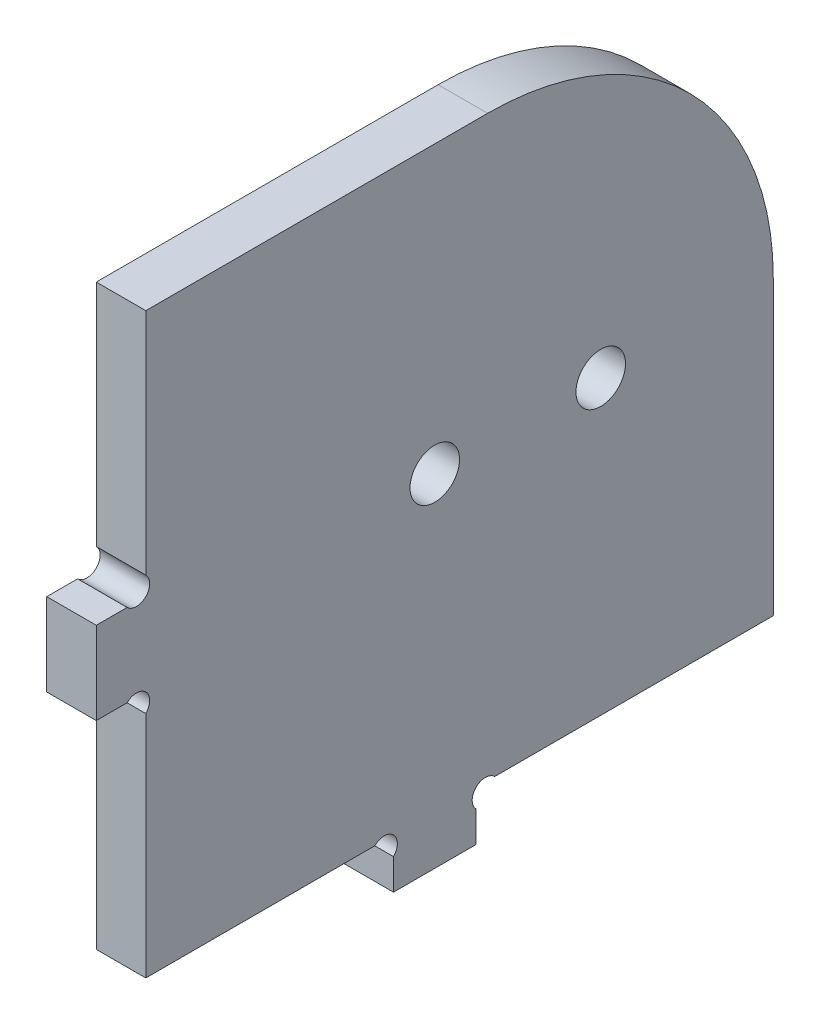
ISO-10303-21;
HEADER;
FILE_DESCRIPTION(('STEP AP214'),'2;1');
FILE_NAME('part.step','',(''),(''),'','','');
FILE_SCHEMA(('AUTOMOTIVE_DESIGN { 1 0 10303 214 1 1 1 1 }'));
ENDSEC;
DATA;
#1=APPLICATION_CONTEXT('core data for automotive mechanical design processes');
#2=APPLICATION_PROTOCOL_DEFINITION('international standard','automotive_design',2000,#1);
#3=PRODUCT_CONTEXT('',#1,'mechanical');
#4=PRODUCT('Part','Part','',(#3));
#5=PRODUCT_RELATED_PRODUCT_CATEGORY('part','',(#4));
#6=PRODUCT_DEFINITION_FORMATION('','',#4);
#7=PRODUCT_DEFINITION_CONTEXT('part definition',#1,'design');
#8=PRODUCT_DEFINITION('design','',#6,#7);
#9=PRODUCT_DEFINITION_SHAPE('','',#8);
#10=(LENGTH_UNIT() NAMED_UNIT(*) SI_UNIT(.MILLI.,.METRE.));
#11=(NAMED_UNIT(*) PLANE_ANGLE_UNIT() SI_UNIT($,.RADIAN.));
#12=(NAMED_UNIT(*) SI_UNIT($,.STERADIAN.) SOLID_ANGLE_UNIT());
#13=UNCERTAINTY_MEASURE_WITH_UNIT(LENGTH_MEASURE(1.E-05),#10,'distance_accuracy_value','');
#14=(GEOMETRIC_REPRESENTATION_CONTEXT(3) GLOBAL_UNCERTAINTY_ASSIGNED_CONTEXT((#13)) GLOBAL_UNIT_ASSIGNED_CONTEXT((#10,
#11,#12)) REPRESENTATION_CONTEXT('',''));
#15=CARTESIAN_POINT('',(0.,0.,0.));
#16=DIRECTION('',(0.,0.,1.));
#17=DIRECTION('',(1.,0.,0.));
#18=AXIS2_PLACEMENT_3D('',#15,#16,#17);
#19=CARTESIAN_POINT('',(6.,4.86862915010152,-47.1313708498985));
#20=DIRECTION('',(1.,0.,0.));
#21=DIRECTION('',(0.,0.,-1.));
#22=AXIS2_PLACEMENT_3D('',#19,#20,#21);
#23=PLANE('',#22);
#24=CARTESIAN_POINT('',(6.,41.4,-41.));
#25=DIRECTION('',(1.,0.,0.));
#26=DIRECTION('',(0.,0.,-1.));
#27=AXIS2_PLACEMENT_3D('',#24,#25,#26);
#28=CIRCLE('',#27,3.);
#29=CARTESIAN_POINT('',(6.,41.4,-44.));
#30=VERTEX_POINT('',#29);
#31=EDGE_CURVE('E187',#30,#30,#28,.T.);
#32=ORIENTED_EDGE('',*,*,#31,.F.);
#33=EDGE_LOOP('',(#32));
#34=FACE_BOUND('',#33,.T.);
#35=CARTESIAN_POINT('',(6.,4.86862915010152,-47.1313708498985));
#36=DIRECTION('',(-1.,0.,0.));
#37=DIRECTION('',(0.,0.,-1.));
#38=AXIS2_PLACEMENT_3D('',#35,#36,#37);
#39=CIRCLE('',#38,1.60000000000001);
#40=CARTESIAN_POINT('',(6.,3.73725830020304,-46.));
#41=VERTEX_POINT('',#40);
#42=CARTESIAN_POINT('',(6.,6.,-48.262741699797));
#43=VERTEX_POINT('',#42);
#44=EDGE_CURVE('E216',#41,#43,#39,.T.);
#45=ORIENTED_EDGE('',*,*,#44,.T.);
#46=DIRECTION('',(0.,0.,-1.));
#47=VECTOR('',#46,1.);
#48=CARTESIAN_POINT('',(6.,6.,-82.));
#49=LINE('',#48,#47);
#50=CARTESIAN_POINT('',(6.,6.,-82.));
#51=VERTEX_POINT('',#50);
#52=EDGE_CURVE('E119',#43,#51,#49,.T.);
#53=ORIENTED_EDGE('',*,*,#52,.T.);
#54=DIRECTION('',(0.,1.,0.));
#55=VECTOR('',#54,1.);
#56=CARTESIAN_POINT('',(6.,41.4,-82.));
#57=LINE('',#56,#55);
#58=CARTESIAN_POINT('',(6.,41.4,-82.));
#59=VERTEX_POINT('',#58);
#60=EDGE_CURVE('E258',#51,#59,#57,.T.);
#61=ORIENTED_EDGE('',*,*,#60,.T.);
#62=CARTESIAN_POINT('',(6.,41.4,-47.4));
#63=DIRECTION('',(1.,0.,0.));
#64=DIRECTION('',(0.,0.,-1.));
#65=AXIS2_PLACEMENT_3D('',#62,#63,#64);
#66=CIRCLE('',#65,34.6);
#67=CARTESIAN_POINT('',(6.,76.,-47.4));
#68=VERTEX_POINT('',#67);
#69=EDGE_CURVE('E277',#59,#68,#66,.T.);
#70=ORIENTED_EDGE('',*,*,#69,.T.);
#71=DIRECTION('',(0.,0.,1.));
#72=VECTOR('',#71,1.);
#73=CARTESIAN_POINT('',(6.,76.,-6.));
#74=LINE('',#73,#72);
#75=CARTESIAN_POINT('',(6.,76.,-6.));
#76=VERTEX_POINT('',#75);
#77=EDGE_CURVE('E274',#68,#76,#74,.T.);
#78=ORIENTED_EDGE('',*,*,#77,.T.);
#79=DIRECTION('',(0.,-1.,0.));
#80=VECTOR('',#79,1.);
#81=CARTESIAN_POINT('',(6.,48.2627416997972,-6.));
#82=LINE('',#81,#80);
#83=CARTESIAN_POINT('',(6.,48.2627416997972,-6.));
#84=VERTEX_POINT('',#83);
#85=EDGE_CURVE('E276',#76,#84,#82,.T.);
#86=ORIENTED_EDGE('',*,*,#85,.T.);
#87=CARTESIAN_POINT('',(6.,47.1313708498986,-4.86862915010136));
#88=DIRECTION('',(-1.,0.,0.));
#89=DIRECTION('',(0.,0.,1.));
#90=AXIS2_PLACEMENT_3D('',#87,#88,#89);
#91=CIRCLE('',#90,1.60000000000023);
#92=CARTESIAN_POINT('',(6.,46.,-3.73725830020272));
#93=VERTEX_POINT('',#92);
#94=EDGE_CURVE('E279',#84,#93,#91,.T.);
#95=ORIENTED_EDGE('',*,*,#94,.T.);
#96=DIRECTION('',(0.,0.,1.));
#97=VECTOR('',#96,1.);
#98=CARTESIAN_POINT('',(6.,46.,0.));
#99=LINE('',#98,#97);
#100=CARTESIAN_POINT('',(6.,46.,0.));
#101=VERTEX_POINT('',#100);
#102=EDGE_CURVE('E285',#93,#101,#99,.T.);
#103=ORIENTED_EDGE('',*,*,#102,.T.);
#104=DIRECTION('',(0.,-1.,0.));
#105=VECTOR('',#104,1.);
#106=CARTESIAN_POINT('',(6.,36.,0.));
#107=LINE('',#106,#105);
#108=CARTESIAN_POINT('',(6.,36.,0.));
#109=VERTEX_POINT('',#108);
#110=EDGE_CURVE('E287',#101,#109,#107,.T.);
#111=ORIENTED_EDGE('',*,*,#110,.T.);
#112=DIRECTION('',(0.,0.,-1.));
#113=VECTOR('',#112,1.);
#114=CARTESIAN_POINT('',(6.,36.,-3.7372583002027));
#115=LINE('',#114,#113);
#116=CARTESIAN_POINT('',(6.,36.,-3.7372583002027));
#117=VERTEX_POINT('',#116);
#118=EDGE_CURVE('E289',#109,#117,#115,.T.);
#119=ORIENTED_EDGE('',*,*,#118,.T.);
#120=CARTESIAN_POINT('',(6.,34.8686291501013,-4.86862915010135));
#121=DIRECTION('',(-1.,0.,0.));
#122=DIRECTION('',(0.,0.,-1.));
#123=AXIS2_PLACEMENT_3D('',#120,#121,#122);
#124=CIRCLE('',#123,1.60000000000024);
#125=CARTESIAN_POINT('',(6.,33.7372583002027,-6.));
#126=VERTEX_POINT('',#125);
#127=EDGE_CURVE('E291',#117,#126,#124,.T.);
#128=ORIENTED_EDGE('',*,*,#127,.T.);
#129=DIRECTION('',(0.,-1.,0.));
#130=VECTOR('',#129,1.);
#131=CARTESIAN_POINT('',(6.,6.,-6.));
#132=LINE('',#131,#130);
#133=CARTESIAN_POINT('',(6.,6.,-6.));
#134=VERTEX_POINT('',#133);
#135=EDGE_CURVE('E293',#126,#134,#132,.T.);
#136=ORIENTED_EDGE('',*,*,#135,.T.);
#137=DIRECTION('',(0.,0.,-1.));
#138=VECTOR('',#137,1.);
#139=CARTESIAN_POINT('',(6.,6.,-33.7372583002031));
#140=LINE('',#139,#138);
#141=CARTESIAN_POINT('',(6.,6.,-33.7372583002031));
#142=VERTEX_POINT('',#141);
#143=EDGE_CURVE('E295',#134,#142,#140,.T.);
#144=ORIENTED_EDGE('',*,*,#143,.T.);
#145=CARTESIAN_POINT('',(6.,4.86862915010151,-34.8686291501015));
#146=DIRECTION('',(-1.,0.,0.));
#147=DIRECTION('',(0.,0.,1.));
#148=AXIS2_PLACEMENT_3D('',#145,#146,#147);
#149=CIRCLE('',#148,1.60000000000001);
#150=CARTESIAN_POINT('',(6.,3.73725830020304,-36.));
#151=VERTEX_POINT('',#150);
#152=EDGE_CURVE('E165',#142,#151,#149,.T.);
#153=ORIENTED_EDGE('',*,*,#152,.T.);
#154=DIRECTION('',(0.,-1.,0.));
#155=VECTOR('',#154,1.);
#156=CARTESIAN_POINT('',(6.,0.,-36.));
#157=LINE('',#156,#155);
#158=CARTESIAN_POINT('',(6.,0.,-36.));
#159=VERTEX_POINT('',#158);
#160=EDGE_CURVE('E159',#151,#159,#157,.T.);
#161=ORIENTED_EDGE('',*,*,#160,.T.);
#162=DIRECTION('',(0.,0.,-1.));
#163=VECTOR('',#162,1.);
#164=CARTESIAN_POINT('',(6.,0.,-46.));
#165=LINE('',#164,#163);
#166=CARTESIAN_POINT('',(6.,0.,-46.));
#167=VERTEX_POINT('',#166);
#168=EDGE_CURVE('E163',#159,#167,#165,.T.);
#169=ORIENTED_EDGE('',*,*,#168,.T.);
#170=DIRECTION('',(0.,1.,0.));
#171=VECTOR('',#170,1.);
#172=CARTESIAN_POINT('',(6.,3.73725830020304,-46.));
#173=LINE('',#172,#171);
#174=EDGE_CURVE('E49',#167,#41,#173,.T.);
#175=ORIENTED_EDGE('',*,*,#174,.T.);
#176=EDGE_LOOP('',(#45,#53,#61,#70,#78,#86,#95,#103,#111,#119,#128,#136,#144,#153,#161,#169,#175));
#177=FACE_BOUND('',#176,.T.);
#178=CARTESIAN_POINT('',(6.,41.4,-61.1));
#179=DIRECTION('',(1.,0.,0.));
#180=DIRECTION('',(0.,0.,-1.));
#181=AXIS2_PLACEMENT_3D('',#178,#179,#180);
#182=CIRCLE('',#181,3.00000000000001);
#183=CARTESIAN_POINT('',(6.,41.4,-64.1));
#184=VERTEX_POINT('',#183);
#185=EDGE_CURVE('E338',#184,#184,#182,.T.);
#186=ORIENTED_EDGE('',*,*,#185,.F.);
#187=EDGE_LOOP('',(#186));
#188=FACE_BOUND('',#187,.T.);
#189=ADVANCED_FACE('F32',(#34,#177,#188),#23,.T.);
#190=CARTESIAN_POINT('',(0.,4.86862915010152,-47.1313708498985));
#191=DIRECTION('',(1.,0.,0.));
#192=DIRECTION('',(0.,0.,-1.));
#193=AXIS2_PLACEMENT_3D('',#190,#191,#192);
#194=PLANE('',#193);
#195=CARTESIAN_POINT('',(0.,41.4,-41.));
#196=DIRECTION('',(1.,0.,0.));
#197=DIRECTION('',(0.,0.,-1.));
#198=AXIS2_PLACEMENT_3D('',#195,#196,#197);
#199=CIRCLE('',#198,3.);
#200=CARTESIAN_POINT('',(0.,41.4,-44.));
#201=VERTEX_POINT('',#200);
#202=EDGE_CURVE('E343',#201,#201,#199,.T.);
#203=ORIENTED_EDGE('',*,*,#202,.T.);
#204=EDGE_LOOP('',(#203));
#205=FACE_BOUND('',#204,.T.);
#206=CARTESIAN_POINT('',(0.,4.86862915010152,-47.1313708498985));
#207=DIRECTION('',(-1.,0.,0.));
#208=DIRECTION('',(0.,0.,-1.));
#209=AXIS2_PLACEMENT_3D('',#206,#207,#208);
#210=CIRCLE('',#209,1.60000000000001);
#211=CARTESIAN_POINT('',(0.,3.73725830020304,-46.));
#212=VERTEX_POINT('',#211);
#213=CARTESIAN_POINT('',(0.,6.,-48.262741699797));
#214=VERTEX_POINT('',#213);
#215=EDGE_CURVE('E183',#212,#214,#210,.T.);
#216=ORIENTED_EDGE('',*,*,#215,.F.);
#217=DIRECTION('',(0.,1.,0.));
#218=VECTOR('',#217,1.);
#219=CARTESIAN_POINT('',(0.,3.73725830020304,-46.));
#220=LINE('',#219,#218);
#221=CARTESIAN_POINT('',(0.,0.,-46.));
#222=VERTEX_POINT('',#221);
#223=EDGE_CURVE('E111',#222,#212,#220,.T.);
#224=ORIENTED_EDGE('',*,*,#223,.F.);
#225=DIRECTION('',(0.,0.,-1.));
#226=VECTOR('',#225,1.);
#227=CARTESIAN_POINT('',(0.,0.,-46.));
#228=LINE('',#227,#226);
#229=CARTESIAN_POINT('',(0.,0.,-36.));
#230=VERTEX_POINT('',#229);
#231=EDGE_CURVE('E105',#230,#222,#228,.T.);
#232=ORIENTED_EDGE('',*,*,#231,.F.);
#233=DIRECTION('',(0.,-1.,0.));
#234=VECTOR('',#233,1.);
#235=CARTESIAN_POINT('',(0.,0.,-36.));
#236=LINE('',#235,#234);
#237=CARTESIAN_POINT('',(0.,3.73725830020304,-36.));
#238=VERTEX_POINT('',#237);
#239=EDGE_CURVE('E173',#238,#230,#236,.T.);
#240=ORIENTED_EDGE('',*,*,#239,.F.);
#241=CARTESIAN_POINT('',(0.,4.86862915010151,-34.8686291501015));
#242=DIRECTION('',(-1.,0.,0.));
#243=DIRECTION('',(0.,0.,1.));
#244=AXIS2_PLACEMENT_3D('',#241,#242,#243);
#245=CIRCLE('',#244,1.60000000000001);
#246=CARTESIAN_POINT('',(0.,6.,-33.7372583002031));
#247=VERTEX_POINT('',#246);
#248=EDGE_CURVE('E211',#247,#238,#245,.T.);
#249=ORIENTED_EDGE('',*,*,#248,.F.);
#250=DIRECTION('',(0.,0.,-1.));
#251=VECTOR('',#250,1.);
#252=CARTESIAN_POINT('',(0.,6.,-33.7372583002031));
#253=LINE('',#252,#251);
#254=CARTESIAN_POINT('',(0.,6.,-6.));
#255=VERTEX_POINT('',#254);
#256=EDGE_CURVE('E209',#255,#247,#253,.T.);
#257=ORIENTED_EDGE('',*,*,#256,.F.);
#258=DIRECTION('',(0.,-1.,0.));
#259=VECTOR('',#258,1.);
#260=CARTESIAN_POINT('',(0.,6.,-6.));
#261=LINE('',#260,#259);
#262=CARTESIAN_POINT('',(0.,33.7372583002027,-6.));
#263=VERTEX_POINT('',#262);
#264=EDGE_CURVE('E207',#263,#255,#261,.T.);
#265=ORIENTED_EDGE('',*,*,#264,.F.);
#266=CARTESIAN_POINT('',(0.,34.8686291501013,-4.86862915010135));
#267=DIRECTION('',(-1.,0.,0.));
#268=DIRECTION('',(0.,0.,-1.));
#269=AXIS2_PLACEMENT_3D('',#266,#267,#268);
#270=CIRCLE('',#269,1.60000000000024);
#271=CARTESIAN_POINT('',(0.,36.,-3.7372583002027));
#272=VERTEX_POINT('',#271);
#273=EDGE_CURVE('E205',#272,#263,#270,.T.);
#274=ORIENTED_EDGE('',*,*,#273,.F.);
#275=DIRECTION('',(0.,0.,-1.));
#276=VECTOR('',#275,1.);
#277=CARTESIAN_POINT('',(0.,36.,-3.7372583002027));
#278=LINE('',#277,#276);
#279=CARTESIAN_POINT('',(0.,36.,0.));
#280=VERTEX_POINT('',#279);
#281=EDGE_CURVE('E203',#280,#272,#278,.T.);
#282=ORIENTED_EDGE('',*,*,#281,.F.);
#283=DIRECTION('',(0.,-1.,0.));
#284=VECTOR('',#283,1.);
#285=CARTESIAN_POINT('',(0.,36.,0.));
#286=LINE('',#285,#284);
#287=CARTESIAN_POINT('',(0.,46.,0.));
#288=VERTEX_POINT('',#287);
#289=EDGE_CURVE('E201',#288,#280,#286,.T.);
#290=ORIENTED_EDGE('',*,*,#289,.F.);
#291=DIRECTION('',(0.,0.,1.));
#292=VECTOR('',#291,1.);
#293=CARTESIAN_POINT('',(0.,46.,0.));
#294=LINE('',#293,#292);
#295=CARTESIAN_POINT('',(0.,46.,-3.73725830020272));
#296=VERTEX_POINT('',#295);
#297=EDGE_CURVE('E199',#296,#288,#294,.T.);
#298=ORIENTED_EDGE('',*,*,#297,.F.);
#299=CARTESIAN_POINT('',(0.,47.1313708498986,-4.86862915010136));
#300=DIRECTION('',(-1.,0.,0.));
#301=DIRECTION('',(0.,0.,1.));
#302=AXIS2_PLACEMENT_3D('',#299,#300,#301);
#303=CIRCLE('',#302,1.60000000000023);
#304=CARTESIAN_POINT('',(0.,48.2627416997972,-6.));
#305=VERTEX_POINT('',#304);
#306=EDGE_CURVE('E197',#305,#296,#303,.T.);
#307=ORIENTED_EDGE('',*,*,#306,.F.);
#308=DIRECTION('',(0.,-1.,0.));
#309=VECTOR('',#308,1.);
#310=CARTESIAN_POINT('',(0.,48.2627416997972,-6.));
#311=LINE('',#310,#309);
#312=CARTESIAN_POINT('',(0.,76.,-6.));
#313=VERTEX_POINT('',#312);
#314=EDGE_CURVE('E195',#313,#305,#311,.T.);
#315=ORIENTED_EDGE('',*,*,#314,.F.);
#316=DIRECTION('',(0.,0.,1.));
#317=VECTOR('',#316,1.);
#318=CARTESIAN_POINT('',(0.,76.,-6.));
#319=LINE('',#318,#317);
#320=CARTESIAN_POINT('',(0.,76.,-47.4));
#321=VERTEX_POINT('',#320);
#322=EDGE_CURVE('E193',#321,#313,#319,.T.);
#323=ORIENTED_EDGE('',*,*,#322,.F.);
#324=CARTESIAN_POINT('',(0.,41.4,-47.4));
#325=DIRECTION('',(1.,0.,0.));
#326=DIRECTION('',(0.,0.,-1.));
#327=AXIS2_PLACEMENT_3D('',#324,#325,#326);
#328=CIRCLE('',#327,34.6);
#329=CARTESIAN_POINT('',(0.,41.4,-82.));
#330=VERTEX_POINT('',#329);
#331=EDGE_CURVE('E191',#330,#321,#328,.T.);
#332=ORIENTED_EDGE('',*,*,#331,.F.);
#333=DIRECTION('',(0.,1.,0.));
#334=VECTOR('',#333,1.);
#335=CARTESIAN_POINT('',(0.,41.4,-82.));
#336=LINE('',#335,#334);
#337=CARTESIAN_POINT('',(0.,6.,-82.));
#338=VERTEX_POINT('',#337);
#339=EDGE_CURVE('E189',#338,#330,#336,.T.);
#340=ORIENTED_EDGE('',*,*,#339,.F.);
#341=DIRECTION('',(0.,0.,-1.));
#342=VECTOR('',#341,1.);
#343=CARTESIAN_POINT('',(0.,6.,-82.));
#344=LINE('',#343,#342);
#345=EDGE_CURVE('E186',#214,#338,#344,.T.);
#346=ORIENTED_EDGE('',*,*,#345,.F.);
#347=EDGE_LOOP('',(#216,#224,#232,#240,#249,#257,#265,#274,#282,#290,#298,#307,#315,#323,#332,
#340,#346));
#348=FACE_BOUND('',#347,.T.);
#349=CARTESIAN_POINT('',(0.,41.4,-61.1));
#350=DIRECTION('',(1.,0.,0.));
#351=DIRECTION('',(0.,0.,-1.));
#352=AXIS2_PLACEMENT_3D('',#349,#350,#351);
#353=CIRCLE('',#352,3.00000000000001);
#354=CARTESIAN_POINT('',(0.,41.4,-64.1));
#355=VERTEX_POINT('',#354);
#356=EDGE_CURVE('E341',#355,#355,#353,.T.);
#357=ORIENTED_EDGE('',*,*,#356,.T.);
#358=EDGE_LOOP('',(#357));
#359=FACE_BOUND('',#358,.T.);
#360=ADVANCED_FACE('F262',(#205,#348,#359),#194,.F.);
#361=CARTESIAN_POINT('',(6.,4.86862915010152,-47.1313708498985));
#362=DIRECTION('',(-1.,0.,0.));
#363=DIRECTION('',(0.,0.,1.));
#364=AXIS2_PLACEMENT_3D('',#361,#362,#363);
#365=CYLINDRICAL_SURFACE('',#364,1.60000000000001);
#366=ORIENTED_EDGE('',*,*,#215,.T.);
#367=DIRECTION('',(-1.,0.,0.));
#368=VECTOR('',#367,1.);
#369=CARTESIAN_POINT('',(6.,6.,-48.262741699797));
#370=LINE('',#369,#368);
#371=EDGE_CURVE('E11',#43,#214,#370,.T.);
#372=ORIENTED_EDGE('',*,*,#371,.F.);
#373=ORIENTED_EDGE('',*,*,#44,.F.);
#374=DIRECTION('',(-1.,0.,0.));
#375=VECTOR('',#374,1.);
#376=CARTESIAN_POINT('',(6.,3.73725830020304,-46.));
#377=LINE('',#376,#375);
#378=EDGE_CURVE('E179',#41,#212,#377,.T.);
#379=ORIENTED_EDGE('',*,*,#378,.T.);
#380=EDGE_LOOP('',(#366,#372,#373,#379));
#381=FACE_BOUND('',#380,.T.);
#382=ADVANCED_FACE('F34',(#381),#365,.F.);
#383=CARTESIAN_POINT('',(6.,6.,-82.));
#384=DIRECTION('',(0.,1.,0.));
#385=DIRECTION('',(0.,0.,1.));
#386=AXIS2_PLACEMENT_3D('',#383,#384,#385);
#387=PLANE('',#386);
#388=ORIENTED_EDGE('',*,*,#345,.T.);
#389=DIRECTION('',(-1.,0.,0.));
#390=VECTOR('',#389,1.);
#391=CARTESIAN_POINT('',(6.,6.,-82.));
#392=LINE('',#391,#390);
#393=EDGE_CURVE('E41',#51,#338,#392,.T.);
#394=ORIENTED_EDGE('',*,*,#393,.F.);
#395=ORIENTED_EDGE('',*,*,#52,.F.);
#396=ORIENTED_EDGE('',*,*,#371,.T.);
#397=EDGE_LOOP('',(#388,#394,#395,#396));
#398=FACE_BOUND('',#397,.T.);
#399=ADVANCED_FACE('F486',(#398),#387,.F.);
#400=CARTESIAN_POINT('',(6.,41.4,-82.));
#401=DIRECTION('',(0.,0.,1.));
#402=DIRECTION('',(1.,0.,0.));
#403=AXIS2_PLACEMENT_3D('',#400,#401,#402);
#404=PLANE('',#403);
#405=ORIENTED_EDGE('',*,*,#339,.T.);
#406=DIRECTION('',(-1.,0.,0.));
#407=VECTOR('',#406,1.);
#408=CARTESIAN_POINT('',(6.,41.4,-82.));
#409=LINE('',#408,#407);
#410=EDGE_CURVE('E250',#59,#330,#409,.T.);
#411=ORIENTED_EDGE('',*,*,#410,.F.);
#412=ORIENTED_EDGE('',*,*,#60,.F.);
#413=ORIENTED_EDGE('',*,*,#393,.T.);
#414=EDGE_LOOP('',(#405,#411,#412,#413));
#415=FACE_BOUND('',#414,.T.);
#416=ADVANCED_FACE('F256',(#415),#404,.F.);
#417=CARTESIAN_POINT('',(6.,41.4,-47.4));
#418=DIRECTION('',(-1.,0.,0.));
#419=DIRECTION('',(0.,0.,1.));
#420=AXIS2_PLACEMENT_3D('',#417,#418,#419);
#421=CYLINDRICAL_SURFACE('',#420,34.6);
#422=ORIENTED_EDGE('',*,*,#331,.T.);
#423=DIRECTION('',(-1.,0.,0.));
#424=VECTOR('',#423,1.);
#425=CARTESIAN_POINT('',(6.,76.,-47.4));
#426=LINE('',#425,#424);
#427=EDGE_CURVE('E247',#68,#321,#426,.T.);
#428=ORIENTED_EDGE('',*,*,#427,.F.);
#429=ORIENTED_EDGE('',*,*,#69,.F.);
#430=ORIENTED_EDGE('',*,*,#410,.T.);
#431=EDGE_LOOP('',(#422,#428,#429,#430));
#432=FACE_BOUND('',#431,.T.);
#433=ADVANCED_FACE('F268',(#432),#421,.T.);
#434=CARTESIAN_POINT('',(6.,76.,-6.));
#435=DIRECTION('',(0.,-1.,0.));
#436=DIRECTION('',(0.,0.,-1.));
#437=AXIS2_PLACEMENT_3D('',#434,#435,#436);
#438=PLANE('',#437);
#439=ORIENTED_EDGE('',*,*,#322,.T.);
#440=DIRECTION('',(-1.,0.,0.));
#441=VECTOR('',#440,1.);
#442=CARTESIAN_POINT('',(6.,76.,-6.));
#443=LINE('',#442,#441);
#444=EDGE_CURVE('E244',#76,#313,#443,.T.);
#445=ORIENTED_EDGE('',*,*,#444,.F.);
#446=ORIENTED_EDGE('',*,*,#77,.F.);
#447=ORIENTED_EDGE('',*,*,#427,.T.);
#448=EDGE_LOOP('',(#439,#445,#446,#447));
#449=FACE_BOUND('',#448,.T.);
#450=ADVANCED_FACE('F272',(#449),#438,.F.);
#451=CARTESIAN_POINT('',(6.,48.2627416997972,-6.));
#452=DIRECTION('',(0.,0.,-1.));
#453=DIRECTION('',(-1.,0.,0.));
#454=AXIS2_PLACEMENT_3D('',#451,#452,#453);
#455=PLANE('',#454);
#456=ORIENTED_EDGE('',*,*,#314,.T.);
#457=DIRECTION('',(-1.,0.,0.));
#458=VECTOR('',#457,1.);
#459=CARTESIAN_POINT('',(6.,48.2627416997972,-6.));
#460=LINE('',#459,#458);
#461=EDGE_CURVE('E241',#84,#305,#460,.T.);
#462=ORIENTED_EDGE('',*,*,#461,.F.);
#463=ORIENTED_EDGE('',*,*,#85,.F.);
#464=ORIENTED_EDGE('',*,*,#444,.T.);
#465=EDGE_LOOP('',(#456,#462,#463,#464));
#466=FACE_BOUND('',#465,.T.);
#467=ADVANCED_FACE('F451',(#466),#455,.F.);
#468=CARTESIAN_POINT('',(6.,47.1313708498986,-4.86862915010136));
#469=DIRECTION('',(-1.,0.,0.));
#470=DIRECTION('',(0.,0.,1.));
#471=AXIS2_PLACEMENT_3D('',#468,#469,#470);
#472=CYLINDRICAL_SURFACE('',#471,1.60000000000023);
#473=ORIENTED_EDGE('',*,*,#306,.T.);
#474=DIRECTION('',(-1.,0.,0.));
#475=VECTOR('',#474,1.);
#476=CARTESIAN_POINT('',(6.,46.,-3.73725830020272));
#477=LINE('',#476,#475);
#478=EDGE_CURVE('E238',#93,#296,#477,.T.);
#479=ORIENTED_EDGE('',*,*,#478,.F.);
#480=ORIENTED_EDGE('',*,*,#94,.F.);
#481=ORIENTED_EDGE('',*,*,#461,.T.);
#482=EDGE_LOOP('',(#473,#479,#480,#481));
#483=FACE_BOUND('',#482,.T.);
#484=ADVANCED_FACE('F441',(#483),#472,.F.);
#485=CARTESIAN_POINT('',(6.,46.,0.));
#486=DIRECTION('',(0.,-1.,0.));
#487=DIRECTION('',(0.,0.,-1.));
#488=AXIS2_PLACEMENT_3D('',#485,#486,#487);
#489=PLANE('',#488);
#490=ORIENTED_EDGE('',*,*,#297,.T.);
#491=DIRECTION('',(-1.,0.,0.));
#492=VECTOR('',#491,1.);
#493=CARTESIAN_POINT('',(6.,46.,0.));
#494=LINE('',#493,#492);
#495=EDGE_CURVE('E235',#101,#288,#494,.T.);
#496=ORIENTED_EDGE('',*,*,#495,.F.);
#497=ORIENTED_EDGE('',*,*,#102,.F.);
#498=ORIENTED_EDGE('',*,*,#478,.T.);
#499=EDGE_LOOP('',(#490,#496,#497,#498));
#500=FACE_BOUND('',#499,.T.);
#501=ADVANCED_FACE('F431',(#500),#489,.F.);
#502=CARTESIAN_POINT('',(6.,36.,0.));
#503=DIRECTION('',(0.,0.,-1.));
#504=DIRECTION('',(-1.,0.,0.));
#505=AXIS2_PLACEMENT_3D('',#502,#503,#504);
#506=PLANE('',#505);
#507=ORIENTED_EDGE('',*,*,#289,.T.);
#508=DIRECTION('',(-1.,0.,0.));
#509=VECTOR('',#508,1.);
#510=CARTESIAN_POINT('',(6.,36.,0.));
#511=LINE('',#510,#509);
#512=EDGE_CURVE('E232',#109,#280,#511,.T.);
#513=ORIENTED_EDGE('',*,*,#512,.F.);
#514=ORIENTED_EDGE('',*,*,#110,.F.);
#515=ORIENTED_EDGE('',*,*,#495,.T.);
#516=EDGE_LOOP('',(#507,#513,#514,#515));
#517=FACE_BOUND('',#516,.T.);
#518=ADVANCED_FACE('F421',(#517),#506,.F.);
#519=CARTESIAN_POINT('',(6.,36.,-3.7372583002027));
#520=DIRECTION('',(0.,1.,0.));
#521=DIRECTION('',(0.,0.,1.));
#522=AXIS2_PLACEMENT_3D('',#519,#520,#521);
#523=PLANE('',#522);
#524=ORIENTED_EDGE('',*,*,#281,.T.);
#525=DIRECTION('',(-1.,0.,0.));
#526=VECTOR('',#525,1.);
#527=CARTESIAN_POINT('',(6.,36.,-3.7372583002027));
#528=LINE('',#527,#526);
#529=EDGE_CURVE('E229',#117,#272,#528,.T.);
#530=ORIENTED_EDGE('',*,*,#529,.F.);
#531=ORIENTED_EDGE('',*,*,#118,.F.);
#532=ORIENTED_EDGE('',*,*,#512,.T.);
#533=EDGE_LOOP('',(#524,#530,#531,#532));
#534=FACE_BOUND('',#533,.T.);
#535=ADVANCED_FACE('F411',(#534),#523,.F.);
#536=CARTESIAN_POINT('',(6.,34.8686291501013,-4.86862915010135));
#537=DIRECTION('',(-1.,0.,0.));
#538=DIRECTION('',(0.,0.,1.));
#539=AXIS2_PLACEMENT_3D('',#536,#537,#538);
#540=CYLINDRICAL_SURFACE('',#539,1.60000000000024);
#541=ORIENTED_EDGE('',*,*,#273,.T.);
#542=DIRECTION('',(-1.,0.,0.));
#543=VECTOR('',#542,1.);
#544=CARTESIAN_POINT('',(6.,33.7372583002027,-6.));
#545=LINE('',#544,#543);
#546=EDGE_CURVE('E226',#126,#263,#545,.T.);
#547=ORIENTED_EDGE('',*,*,#546,.F.);
#548=ORIENTED_EDGE('',*,*,#127,.F.);
#549=ORIENTED_EDGE('',*,*,#529,.T.);
#550=EDGE_LOOP('',(#541,#547,#548,#549));
#551=FACE_BOUND('',#550,.T.);
#552=ADVANCED_FACE('F401',(#551),#540,.F.);
#553=CARTESIAN_POINT('',(6.,6.,-6.));
#554=DIRECTION('',(0.,0.,-1.));
#555=DIRECTION('',(-1.,0.,0.));
#556=AXIS2_PLACEMENT_3D('',#553,#554,#555);
#557=PLANE('',#556);
#558=ORIENTED_EDGE('',*,*,#264,.T.);
#559=DIRECTION('',(-1.,0.,0.));
#560=VECTOR('',#559,1.);
#561=CARTESIAN_POINT('',(6.,6.,-6.));
#562=LINE('',#561,#560);
#563=EDGE_CURVE('E223',#134,#255,#562,.T.);
#564=ORIENTED_EDGE('',*,*,#563,.F.);
#565=ORIENTED_EDGE('',*,*,#135,.F.);
#566=ORIENTED_EDGE('',*,*,#546,.T.);
#567=EDGE_LOOP('',(#558,#564,#565,#566));
#568=FACE_BOUND('',#567,.T.);
#569=ADVANCED_FACE('F392',(#568),#557,.F.);
#570=CARTESIAN_POINT('',(6.,6.,-33.7372583002031));
#571=DIRECTION('',(0.,1.,0.));
#572=DIRECTION('',(0.,0.,1.));
#573=AXIS2_PLACEMENT_3D('',#570,#571,#572);
#574=PLANE('',#573);
#575=ORIENTED_EDGE('',*,*,#256,.T.);
#576=DIRECTION('',(-1.,0.,0.));
#577=VECTOR('',#576,1.);
#578=CARTESIAN_POINT('',(6.,6.,-33.7372583002031));
#579=LINE('',#578,#577);
#580=EDGE_CURVE('E220',#142,#247,#579,.T.);
#581=ORIENTED_EDGE('',*,*,#580,.F.);
#582=ORIENTED_EDGE('',*,*,#143,.F.);
#583=ORIENTED_EDGE('',*,*,#563,.T.);
#584=EDGE_LOOP('',(#575,#581,#582,#583));
#585=FACE_BOUND('',#584,.T.);
#586=ADVANCED_FACE('F301',(#585),#574,.F.);
#587=CARTESIAN_POINT('',(6.,4.86862915010151,-34.8686291501015));
#588=DIRECTION('',(-1.,0.,0.));
#589=DIRECTION('',(0.,0.,1.));
#590=AXIS2_PLACEMENT_3D('',#587,#588,#589);
#591=CYLINDRICAL_SURFACE('',#590,1.60000000000001);
#592=ORIENTED_EDGE('',*,*,#248,.T.);
#593=DIRECTION('',(-1.,0.,0.));
#594=VECTOR('',#593,1.);
#595=CARTESIAN_POINT('',(6.,3.73725830020304,-36.));
#596=LINE('',#595,#594);
#597=EDGE_CURVE('E174',#151,#238,#596,.T.);
#598=ORIENTED_EDGE('',*,*,#597,.F.);
#599=ORIENTED_EDGE('',*,*,#152,.F.);
#600=ORIENTED_EDGE('',*,*,#580,.T.);
#601=EDGE_LOOP('',(#592,#598,#599,#600));
#602=FACE_BOUND('',#601,.T.);
#603=ADVANCED_FACE('F305',(#602),#591,.F.);
#604=CARTESIAN_POINT('',(6.,0.,-36.));
#605=DIRECTION('',(0.,0.,-1.));
#606=DIRECTION('',(0.,1.,0.));
#607=AXIS2_PLACEMENT_3D('',#604,#605,#606);
#608=PLANE('',#607);
#609=ORIENTED_EDGE('',*,*,#239,.T.);
#610=DIRECTION('',(-1.,0.,0.));
#611=VECTOR('',#610,1.);
#612=CARTESIAN_POINT('',(6.,0.,-36.));
#613=LINE('',#612,#611);
#614=EDGE_CURVE('E170',#159,#230,#613,.T.);
#615=ORIENTED_EDGE('',*,*,#614,.F.);
#616=ORIENTED_EDGE('',*,*,#160,.F.);
#617=ORIENTED_EDGE('',*,*,#597,.T.);
#618=EDGE_LOOP('',(#609,#615,#616,#617));
#619=FACE_BOUND('',#618,.T.);
#620=ADVANCED_FACE('F171',(#619),#608,.F.);
#621=CARTESIAN_POINT('',(6.,0.,-46.));
#622=DIRECTION('',(0.,1.,0.));
#623=DIRECTION('',(0.,0.,1.));
#624=AXIS2_PLACEMENT_3D('',#621,#622,#623);
#625=PLANE('',#624);
#626=ORIENTED_EDGE('',*,*,#231,.T.);
#627=DIRECTION('',(-1.,0.,0.));
#628=VECTOR('',#627,1.);
#629=CARTESIAN_POINT('',(6.,0.,-46.));
#630=LINE('',#629,#628);
#631=EDGE_CURVE('E175',#167,#222,#630,.T.);
#632=ORIENTED_EDGE('',*,*,#631,.F.);
#633=ORIENTED_EDGE('',*,*,#168,.F.);
#634=ORIENTED_EDGE('',*,*,#614,.T.);
#635=EDGE_LOOP('',(#626,#632,#633,#634));
#636=FACE_BOUND('',#635,.T.);
#637=ADVANCED_FACE('F177',(#636),#625,.F.);
#638=CARTESIAN_POINT('',(6.,3.73725830020304,-46.));
#639=DIRECTION('',(0.,0.,1.));
#640=DIRECTION('',(1.,0.,0.));
#641=AXIS2_PLACEMENT_3D('',#638,#639,#640);
#642=PLANE('',#641);
#643=ORIENTED_EDGE('',*,*,#223,.T.);
#644=ORIENTED_EDGE('',*,*,#378,.F.);
#645=ORIENTED_EDGE('',*,*,#174,.F.);
#646=ORIENTED_EDGE('',*,*,#631,.T.);
#647=EDGE_LOOP('',(#643,#644,#645,#646));
#648=FACE_BOUND('',#647,.T.);
#649=ADVANCED_FACE('F309',(#648),#642,.F.);
#650=CARTESIAN_POINT('',(6.,41.4,-41.));
#651=DIRECTION('',(-1.,0.,0.));
#652=DIRECTION('',(0.,0.,1.));
#653=AXIS2_PLACEMENT_3D('',#650,#651,#652);
#654=CYLINDRICAL_SURFACE('',#653,3.);
#655=ORIENTED_EDGE('',*,*,#31,.T.);
#656=EDGE_LOOP('',(#655));
#657=FACE_BOUND('',#656,.T.);
#658=ORIENTED_EDGE('',*,*,#202,.F.);
#659=EDGE_LOOP('',(#658));
#660=FACE_BOUND('',#659,.T.);
#661=ADVANCED_FACE('F311',(#657,#660),#654,.F.);
#662=CARTESIAN_POINT('',(6.,41.4,-61.1));
#663=DIRECTION('',(-1.,0.,0.));
#664=DIRECTION('',(0.,0.,1.));
#665=AXIS2_PLACEMENT_3D('',#662,#663,#664);
#666=CYLINDRICAL_SURFACE('',#665,3.00000000000001);
#667=ORIENTED_EDGE('',*,*,#185,.T.);
#668=EDGE_LOOP('',(#667));
#669=FACE_BOUND('',#668,.T.);
#670=ORIENTED_EDGE('',*,*,#356,.F.);
#671=EDGE_LOOP('',(#670));
#672=FACE_BOUND('',#671,.T.);
#673=ADVANCED_FACE('F317',(#669,#672),#666,.F.);
#674=CLOSED_SHELL('',(#189,#360,#382,#399,#416,#433,#450,#467,#484,#501,#518,#535,#552,#569,
#586,#603,#620,#637,#649,#661,#673));
#675=MANIFOLD_SOLID_BREP('B2',#674);
#676=ADVANCED_BREP_SHAPE_REPRESENTATION('',(#18,#675),#14);
#677=SHAPE_DEFINITION_REPRESENTATION(#9,#676);
ENDSEC;
END-ISO-10303-21;
